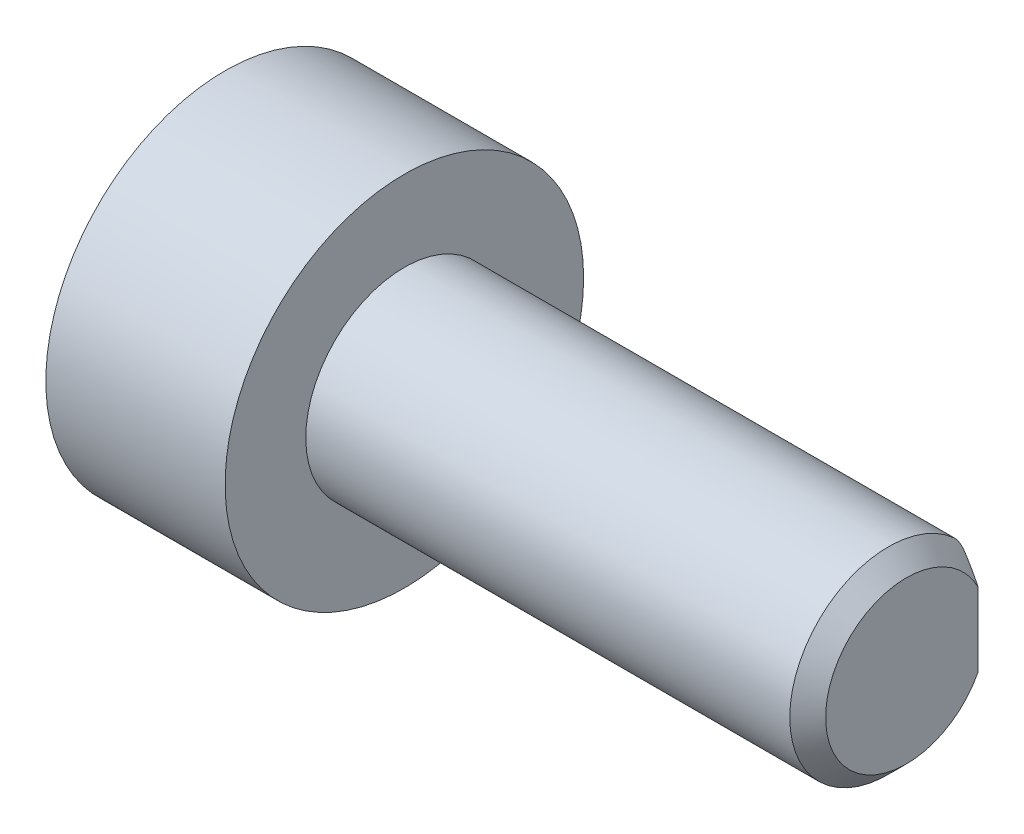
ISO-10303-21;
HEADER;
FILE_DESCRIPTION(('STEP AP214'),'2;1');
FILE_NAME('part.step','',(''),(''),'','','');
FILE_SCHEMA(('AUTOMOTIVE_DESIGN { 1 0 10303 214 1 1 1 1 }'));
ENDSEC;
DATA;
#1=APPLICATION_CONTEXT('core data for automotive mechanical design processes');
#2=APPLICATION_PROTOCOL_DEFINITION('international standard','automotive_design',2000,#1);
#3=PRODUCT_CONTEXT('',#1,'mechanical');
#4=PRODUCT('Part','Part','',(#3));
#5=PRODUCT_RELATED_PRODUCT_CATEGORY('part','',(#4));
#6=PRODUCT_DEFINITION_FORMATION('','',#4);
#7=PRODUCT_DEFINITION_CONTEXT('part definition',#1,'design');
#8=PRODUCT_DEFINITION('design','',#6,#7);
#9=PRODUCT_DEFINITION_SHAPE('','',#8);
#10=(LENGTH_UNIT() NAMED_UNIT(*) SI_UNIT(.MILLI.,.METRE.));
#11=(NAMED_UNIT(*) PLANE_ANGLE_UNIT() SI_UNIT($,.RADIAN.));
#12=(NAMED_UNIT(*) SI_UNIT($,.STERADIAN.) SOLID_ANGLE_UNIT());
#13=UNCERTAINTY_MEASURE_WITH_UNIT(LENGTH_MEASURE(1.E-05),#10,'distance_accuracy_value','');
#14=(GEOMETRIC_REPRESENTATION_CONTEXT(3) GLOBAL_UNCERTAINTY_ASSIGNED_CONTEXT((#13)) GLOBAL_UNIT_ASSIGNED_CONTEXT((#10,
#11,#12)) REPRESENTATION_CONTEXT('',''));
#15=CARTESIAN_POINT('',(0.,0.,0.));
#16=DIRECTION('',(0.,0.,1.));
#17=DIRECTION('',(1.,0.,0.));
#18=AXIS2_PLACEMENT_3D('',#15,#16,#17);
#19=CARTESIAN_POINT('',(21.2171867327833,0.,-7.5));
#20=DIRECTION('',(1.,0.,0.));
#21=DIRECTION('',(0.,0.,-1.));
#22=AXIS2_PLACEMENT_3D('',#19,#20,#21);
#23=PLANE('',#22);
#24=DIRECTION('',(0.,-1.,0.));
#25=VECTOR('',#24,1.);
#26=CARTESIAN_POINT('',(21.2171867327833,0.,-9.5));
#27=LINE('',#26,#25);
#28=CARTESIAN_POINT('',(21.2171867327833,1.03077640640442,-9.5));
#29=VERTEX_POINT('',#28);
#30=CARTESIAN_POINT('',(21.2171867327833,-1.03077640640442,-9.5));
#31=VERTEX_POINT('',#30);
#32=EDGE_CURVE('E123',#29,#31,#27,.T.);
#33=ORIENTED_EDGE('',*,*,#32,.F.);
#34=CARTESIAN_POINT('',(21.2171867327833,0.,-7.5));
#35=DIRECTION('',(1.,0.,0.));
#36=DIRECTION('',(0.,0.,-1.));
#37=AXIS2_PLACEMENT_3D('',#34,#35,#36);
#38=CIRCLE('',#37,2.25);
#39=EDGE_CURVE('E136',#29,#31,#38,.T.);
#40=ORIENTED_EDGE('',*,*,#39,.T.);
#41=EDGE_LOOP('',(#33,#40));
#42=FACE_BOUND('',#41,.T.);
#43=ADVANCED_FACE('F73',(#42),#23,.T.);
#44=CARTESIAN_POINT('',(8.21718673278332,0.,-9.5));
#45=DIRECTION('',(0.,0.,1.));
#46=DIRECTION('',(1.,0.,0.));
#47=AXIS2_PLACEMENT_3D('',#44,#45,#46);
#48=PLANE('',#47);
#49=DIRECTION('',(0.,-1.,0.));
#50=VECTOR('',#49,1.);
#51=CARTESIAN_POINT('',(8.21718673278332,0.,-9.5));
#52=LINE('',#51,#50);
#53=CARTESIAN_POINT('',(8.21718673278332,1.67705098312484,-9.5));
#54=VERTEX_POINT('',#53);
#55=CARTESIAN_POINT('',(8.21718673278332,-1.67705098312484,-9.5));
#56=VERTEX_POINT('',#55);
#57=EDGE_CURVE('E138',#54,#56,#52,.T.);
#58=ORIENTED_EDGE('',*,*,#57,.F.);
#59=DIRECTION('',(-1.,0.,0.));
#60=VECTOR('',#59,1.);
#61=CARTESIAN_POINT('',(8.21718673278332,1.67705098312484,-9.5));
#62=LINE('',#61,#60);
#63=CARTESIAN_POINT('',(20.8571101055613,1.67705098311606,-9.5));
#64=VERTEX_POINT('',#63);
#65=EDGE_CURVE('E126',#54,#64,#62,.F.);
#66=ORIENTED_EDGE('',*,*,#65,.T.);
#67=CARTESIAN_POINT('',(18.1411430279599,4.93626797749979,-9.5));
#68=CARTESIAN_POINT('',(18.2788130430156,4.78768381124845,-9.5));
#69=CARTESIAN_POINT('',(18.4160555329536,4.63869756596273,-9.5));
#70=CARTESIAN_POINT('',(18.6893271391354,4.33955728207182,-9.5));
#71=CARTESIAN_POINT('',(18.8253559820497,4.18940299398388,-9.5));
#72=CARTESIAN_POINT('',(19.0965910697694,3.88672415849227,-9.5));
#73=CARTESIAN_POINT('',(19.2317875058129,3.7341908006299,-9.5));
#74=CARTESIAN_POINT('',(19.4998706434131,3.42713160304089,-9.5));
#75=CARTESIAN_POINT('',(19.6327576154559,3.27260600039063,-9.5));
#76=CARTESIAN_POINT('',(19.8688283379667,2.99210640438999,-9.5));
#77=CARTESIAN_POINT('',(19.9726119138857,2.86663901089742,-9.5));
#78=CARTESIAN_POINT('',(20.1772539947885,2.61328277643716,-9.5));
#79=CARTESIAN_POINT('',(20.2781117860458,2.48539335700056,-9.5));
#80=CARTESIAN_POINT('',(20.475485774688,2.22650548443355,-9.5));
#81=CARTESIAN_POINT('',(20.5720069701796,2.09551089088957,-9.5));
#82=CARTESIAN_POINT('',(20.7119538518751,1.89566419584529,-9.5));
#83=CARTESIAN_POINT('',(20.7577892341795,1.82850179908419,-9.5));
#84=CARTESIAN_POINT('',(20.8474326024016,1.69284128038714,-9.5));
#85=CARTESIAN_POINT('',(20.8912408129102,1.6243433076209,-9.5));
#86=CARTESIAN_POINT('',(20.9749435615259,1.48797798387185,-9.5));
#87=CARTESIAN_POINT('',(21.0149183529494,1.42016017631465,-9.5));
#88=CARTESIAN_POINT('',(21.0918133765513,1.28282423563599,-9.5));
#89=CARTESIAN_POINT('',(21.128734302444,1.21330649334524,-9.5));
#90=CARTESIAN_POINT('',(21.1986682538951,1.07234023444371,-9.5));
#91=CARTESIAN_POINT('',(21.2316829079463,1.00089253778241,-9.5));
#92=CARTESIAN_POINT('',(21.2927268461574,0.855927305144281,-9.5));
#93=CARTESIAN_POINT('',(21.3207575240726,0.782410354510833,-9.5));
#94=CARTESIAN_POINT('',(21.3845148498145,0.591196656014617,-9.5));
#95=CARTESIAN_POINT('',(21.4157234133134,0.471874440503055,-9.5));
#96=CARTESIAN_POINT('',(21.4470852865637,0.290464949037778,-9.5));
#97=CARTESIAN_POINT('',(21.4549638228976,0.229673626127389,-9.5));
#98=CARTESIAN_POINT('',(21.4652144208217,0.107614500574365,-9.5));
#99=CARTESIAN_POINT('',(21.4675868079584,0.0463467263164306,-9.5));
#100=CARTESIAN_POINT('',(21.466674366834,-0.0763197942470239,-9.5));
#101=CARTESIAN_POINT('',(21.4633732659135,-0.13771841112712,-9.5));
#102=CARTESIAN_POINT('',(21.4512794655696,-0.259968375583727,-9.5));
#103=CARTESIAN_POINT('',(21.4424863337877,-0.32081967969058,-9.5));
#104=CARTESIAN_POINT('',(21.41984523005,-0.441758386957264,-9.5));
#105=CARTESIAN_POINT('',(21.4059815262378,-0.501842803788235,-9.5));
#106=CARTESIAN_POINT('',(21.3738365275551,-0.620801694696711,-9.5));
#107=CARTESIAN_POINT('',(21.3555550213248,-0.679676110738195,-9.5));
#108=CARTESIAN_POINT('',(21.2907204712733,-0.867010178133702,-9.5));
#109=CARTESIAN_POINT('',(21.2368423419104,-0.992934833748139,-9.5));
#110=CARTESIAN_POINT('',(21.1170061911796,-1.23892735531401,-9.5));
#111=CARTESIAN_POINT('',(21.0510237798956,-1.35898276485903,-9.5));
#112=CARTESIAN_POINT('',(20.9103161028592,-1.59585458502191,-9.5));
#113=CARTESIAN_POINT('',(20.8354907158075,-1.71261073718882,-9.5));
#114=CARTESIAN_POINT('',(20.6805236919714,-1.94233316376554,-9.5));
#115=CARTESIAN_POINT('',(20.6003869585216,-2.0553027926301,-9.5));
#116=CARTESIAN_POINT('',(20.4256403467432,-2.29310526083194,-9.5));
#117=CARTESIAN_POINT('',(20.3305098463042,-2.41755314631458,-9.5));
#118=CARTESIAN_POINT('',(20.1369570918174,-2.6638718544649,-9.5));
#119=CARTESIAN_POINT('',(20.0385343725834,-2.78574230894001,-9.5));
#120=CARTESIAN_POINT('',(19.8392448282164,-3.02764935246807,-9.5));
#121=CARTESIAN_POINT('',(19.7383758414546,-3.14768415452677,-9.5));
#122=CARTESIAN_POINT('',(19.5348934572522,-3.38626695152412,-9.5));
#123=CARTESIAN_POINT('',(19.4322800159241,-3.50481490892543,-9.5));
#124=CARTESIAN_POINT('',(19.231695068775,-3.73393503767577,-9.5));
#125=CARTESIAN_POINT('',(19.1337978298912,-3.84457235346526,-9.5));
#126=CARTESIAN_POINT('',(18.9370739733265,-4.06502066506249,-9.5));
#127=CARTESIAN_POINT('',(18.8382473370923,-4.17483164429524,-9.5));
#128=CARTESIAN_POINT('',(18.6400483457893,-4.39356418106756,-9.5));
#129=CARTESIAN_POINT('',(18.5406774558616,-4.50248706778862,-9.5));
#130=CARTESIAN_POINT('',(18.3413316646478,-4.71977019005837,-9.5));
#131=CARTESIAN_POINT('',(18.2413567898755,-4.82813044992246,-9.5));
#132=CARTESIAN_POINT('',(18.1411430279599,-4.93626797749979,-9.5));
#133=B_SPLINE_CURVE_WITH_KNOTS('',3,(#67,#68,#69,#70,#71,#72,#73,#74,#75,#76,#77,#78,#79,#80,
#81,#82,#83,#84,#85,#86,#87,#88,#89,#90,#91,#92,#93,#94,#95,#96,#97,#98,#99,#100,#101,#102,#103,
#104,#105,#106,#107,#108,#109,#110,#111,#112,#113,#114,#115,#116,#117,#118,#119,#120,#121,#122,
#123,#124,#125,#126,#127,#128,#129,#130,#131,#132),.UNSPECIFIED.,.F.,.F.,(4,2,2,2,2,2,2,2,2,2,2,
2,2,2,2,2,2,2,2,2,2,2,2,2,2,2,2,2,2,2,2,2,4),(0.,0.607683822515698,1.21550121371795,
1.82695959733874,2.43834587720767,2.92679827952436,3.41536885142092,3.90336106917609,
4.14727001406462,4.39115187121072,4.62725676477005,4.86330787673308,5.09926023157596,
5.33514649886008,5.70350071953634,5.88718743593393,6.07086329173091,6.25506684494243,
6.4392849013503,6.62407942586769,6.80888279321206,7.21864694206685,7.62924601323271,
8.04504397302747,8.46046328332824,8.93031101628626,9.40022542091194,9.87057139026385,
10.3409292103109,10.7841162696073,11.2273121949651,11.6696319276303,12.1119323824531),.UNSPECIFIED.);
#134=EDGE_CURVE('E120',#64,#29,#133,.T.);
#135=ORIENTED_EDGE('',*,*,#134,.T.);
#136=ORIENTED_EDGE('',*,*,#32,.T.);
#137=CARTESIAN_POINT('',(20.8571101055557,-1.67705098312487,-9.5));
#138=VERTEX_POINT('',#137);
#139=EDGE_CURVE('E132',#31,#138,#133,.T.);
#140=ORIENTED_EDGE('',*,*,#139,.T.);
#141=DIRECTION('',(-1.,0.,0.));
#142=VECTOR('',#141,1.);
#143=CARTESIAN_POINT('',(8.21718673278332,-1.67705098312484,-9.5));
#144=LINE('',#143,#142);
#145=EDGE_CURVE('E90',#138,#56,#144,.T.);
#146=ORIENTED_EDGE('',*,*,#145,.T.);
#147=EDGE_LOOP('',(#58,#66,#135,#136,#140,#146));
#148=FACE_BOUND('',#147,.T.);
#149=ADVANCED_FACE('F122',(#148),#48,.F.);
#150=CARTESIAN_POINT('',(21.2171867327833,-1.67705098312484,-9.));
#151=DIRECTION('',(-1.,0.,0.));
#152=DIRECTION('',(0.,0.,1.));
#153=AXIS2_PLACEMENT_3D('',#150,#151,#152);
#154=CYLINDRICAL_SURFACE('',#153,0.5);
#155=CARTESIAN_POINT('',(8.21718673278332,-1.67705098312484,-9.));
#156=DIRECTION('',(1.,0.,0.));
#157=DIRECTION('',(0.,0.,-1.));
#158=AXIS2_PLACEMENT_3D('',#155,#156,#157);
#159=CIRCLE('',#158,0.5);
#160=CARTESIAN_POINT('',(8.21718673278332,-2.0497289793748,-9.33333333333333));
#161=VERTEX_POINT('',#160);
#162=EDGE_CURVE('E12',#56,#161,#159,.F.);
#163=ORIENTED_EDGE('',*,*,#162,.F.);
#164=ORIENTED_EDGE('',*,*,#145,.F.);
#165=CARTESIAN_POINT('',(20.7171867327833,-2.0497289793748,-9.33333333333333));
#166=CARTESIAN_POINT('',(20.7171604513596,-2.03406008435981,-9.35090657468825));
#167=CARTESIAN_POINT('',(20.718545206187,-2.01712587378831,-9.36729410292724));
#168=CARTESIAN_POINT('',(20.7239153109135,-1.98150274794836,-9.39728784026081));
#169=CARTESIAN_POINT('',(20.72788352115,-1.96282608750837,-9.41091160935768));
#170=CARTESIAN_POINT('',(20.7381954360339,-1.92430344352461,-9.43518626032212));
#171=CARTESIAN_POINT('',(20.7445351160157,-1.90445948883267,-9.44584212592262));
#172=CARTESIAN_POINT('',(20.7592855750011,-1.86415682498977,-9.46420065151583));
#173=CARTESIAN_POINT('',(20.7676999401024,-1.84369710582503,-9.47189813836426));
#174=CARTESIAN_POINT('',(20.7869249029712,-1.80125368819481,-9.48487212739723));
#175=CARTESIAN_POINT('',(20.7978629879389,-1.77926466300742,-9.48993860384102));
#176=CARTESIAN_POINT('',(20.8213465509876,-1.73570122571514,-9.49703799103409));
#177=CARTESIAN_POINT('',(20.8338903416531,-1.7141264053145,-9.4990740584367));
#178=CARTESIAN_POINT('',(20.8503785908946,-1.68761215599062,-9.49991682265028));
#179=CARTESIAN_POINT('',(20.8537256314886,-1.68231822084312,-9.50000010394867));
#180=CARTESIAN_POINT('',(20.8571101055586,-1.6770509831203,-9.5));
#181=B_SPLINE_CURVE_WITH_KNOTS('',3,(#165,#166,#167,#168,#169,#170,#171,#172,#173,#174,#175,
#176,#177,#178,#179,#180),.UNSPECIFIED.,.F.,.F.,(4,2,2,2,2,2,2,4),(0.,0.0704675223576055,
0.140472235075229,0.210358676557888,0.280366774315093,0.355332149179519,0.430219380889106,
0.449006975884522),.UNSPECIFIED.);
#182=CARTESIAN_POINT('',(20.7171867327833,-2.0497289793748,-9.33333333333333));
#183=VERTEX_POINT('',#182);
#184=EDGE_CURVE('E169',#183,#138,#181,.T.);
#185=ORIENTED_EDGE('',*,*,#184,.F.);
#186=DIRECTION('',(-1.,0.,0.));
#187=VECTOR('',#186,1.);
#188=CARTESIAN_POINT('',(21.2171867327833,-2.0497289793748,-9.33333333333333));
#189=LINE('',#188,#187);
#190=EDGE_CURVE('E157',#161,#183,#189,.F.);
#191=ORIENTED_EDGE('',*,*,#190,.F.);
#192=EDGE_LOOP('',(#163,#164,#185,#191));
#193=FACE_BOUND('',#192,.T.);
#194=ADVANCED_FACE('F75',(#193),#154,.T.);
#195=CARTESIAN_POINT('',(8.21718673278332,0.,0.));
#196=DIRECTION('',(1.,0.,0.));
#197=DIRECTION('',(0.,0.,-1.));
#198=AXIS2_PLACEMENT_3D('',#195,#196,#197);
#199=PLANE('',#198);
#200=CARTESIAN_POINT('',(8.21718673278332,0.,-7.5));
#201=DIRECTION('',(1.,0.,0.));
#202=DIRECTION('',(0.,0.,-1.));
#203=AXIS2_PLACEMENT_3D('',#200,#201,#202);
#204=CIRCLE('',#203,2.75);
#205=CARTESIAN_POINT('',(8.21718673278332,2.04972897937481,-9.33333333333333));
#206=VERTEX_POINT('',#205);
#207=EDGE_CURVE('E149',#161,#206,#204,.T.);
#208=ORIENTED_EDGE('',*,*,#207,.T.);
#209=CARTESIAN_POINT('',(8.21718673278332,1.67705098312484,-9.));
#210=DIRECTION('',(1.,0.,0.));
#211=DIRECTION('',(0.,0.,-1.));
#212=AXIS2_PLACEMENT_3D('',#209,#210,#211);
#213=CIRCLE('',#212,0.5);
#214=EDGE_CURVE('E83',#206,#54,#213,.F.);
#215=ORIENTED_EDGE('',*,*,#214,.T.);
#216=ORIENTED_EDGE('',*,*,#57,.T.);
#217=ORIENTED_EDGE('',*,*,#162,.T.);
#218=EDGE_LOOP('',(#208,#215,#216,#217));
#219=FACE_BOUND('',#218,.T.);
#220=ADVANCED_FACE('F203',(#219),#199,.T.);
#221=CARTESIAN_POINT('',(21.2171867327833,1.67705098312484,-9.));
#222=DIRECTION('',(-1.,0.,0.));
#223=DIRECTION('',(0.,0.,1.));
#224=AXIS2_PLACEMENT_3D('',#221,#222,#223);
#225=CYLINDRICAL_SURFACE('',#224,0.5);
#226=CARTESIAN_POINT('',(20.8571101055613,1.67705098312484,-9.5));
#227=CARTESIAN_POINT('',(20.8415496974984,1.70124944097462,-9.5000148527075));
#228=CARTESIAN_POINT('',(20.8267655707064,1.72606787067869,-9.49824108320522));
#229=CARTESIAN_POINT('',(20.799206935048,1.77644423051924,-9.49068481003503));
#230=CARTESIAN_POINT('',(20.7864488708806,1.80200639830253,-9.48487137689067));
#231=CARTESIAN_POINT('',(20.7654036136021,1.84906984601313,-9.47002288433717));
#232=CARTESIAN_POINT('',(20.7567309273932,1.87059336762355,-9.46161773600028));
#233=CARTESIAN_POINT('',(20.741760286762,1.91281174579968,-9.44154273159468));
#234=CARTESIAN_POINT('',(20.7354504423934,1.93351026990007,-9.42988975058789));
#235=CARTESIAN_POINT('',(20.7261397670755,1.97088949039679,-9.40508469993059));
#236=CARTESIAN_POINT('',(20.7228181713674,1.98774489361128,-9.3923170049847));
#237=CARTESIAN_POINT('',(20.7183236569058,2.02000307567556,-9.36448352788813));
#238=CARTESIAN_POINT('',(20.7171688583107,2.03539259150949,-9.34939949693643));
#239=CARTESIAN_POINT('',(20.7171867327833,2.0497289793748,-9.33333333333333));
#240=B_SPLINE_CURVE_WITH_KNOTS('',3,(#226,#227,#228,#229,#230,#231,#232,#233,#234,#235,#236,
#237,#238,#239),.UNSPECIFIED.,.F.,.F.,(4,2,2,2,2,2,4),(0.,0.0863985690914003,0.173466039674812,
0.247196248615131,0.320550291890411,0.384489364918406,0.448960795055635),.UNSPECIFIED.);
#241=CARTESIAN_POINT('',(20.7171867327833,2.04972897937481,-9.33333333333333));
#242=VERTEX_POINT('',#241);
#243=EDGE_CURVE('E177',#64,#242,#240,.T.);
#244=ORIENTED_EDGE('',*,*,#243,.F.);
#245=ORIENTED_EDGE('',*,*,#65,.F.);
#246=ORIENTED_EDGE('',*,*,#214,.F.);
#247=DIRECTION('',(-1.,0.,0.));
#248=VECTOR('',#247,1.);
#249=CARTESIAN_POINT('',(21.2171867327833,2.04972897937481,-9.33333333333333));
#250=LINE('',#249,#248);
#251=EDGE_CURVE('E161',#242,#206,#250,.T.);
#252=ORIENTED_EDGE('',*,*,#251,.F.);
#253=EDGE_LOOP('',(#244,#245,#246,#252));
#254=FACE_BOUND('',#253,.T.);
#255=ADVANCED_FACE('F186',(#254),#225,.T.);
#256=CARTESIAN_POINT('',(21.2171867327833,0.,-7.5));
#257=DIRECTION('',(-1.,0.,0.));
#258=DIRECTION('',(0.,0.,1.));
#259=AXIS2_PLACEMENT_3D('',#256,#257,#258);
#260=CONICAL_SURFACE('',#259,2.25,0.785398163397451);
#261=ORIENTED_EDGE('',*,*,#134,.F.);
#262=ORIENTED_EDGE('',*,*,#243,.T.);
#263=CARTESIAN_POINT('',(20.7171867327833,0.,-7.5));
#264=DIRECTION('',(1.,0.,0.));
#265=DIRECTION('',(0.,0.,-1.));
#266=AXIS2_PLACEMENT_3D('',#263,#264,#265);
#267=CIRCLE('',#266,2.75);
#268=EDGE_CURVE('E143',#183,#242,#267,.F.);
#269=ORIENTED_EDGE('',*,*,#268,.F.);
#270=ORIENTED_EDGE('',*,*,#184,.T.);
#271=ORIENTED_EDGE('',*,*,#139,.F.);
#272=ORIENTED_EDGE('',*,*,#39,.F.);
#273=EDGE_LOOP('',(#261,#262,#269,#270,#271,#272));
#274=FACE_BOUND('',#273,.T.);
#275=ADVANCED_FACE('F141',(#274),#260,.T.);
#276=CARTESIAN_POINT('',(21.2171867327833,0.,-7.5));
#277=DIRECTION('',(-1.,0.,0.));
#278=DIRECTION('',(0.,0.,1.));
#279=AXIS2_PLACEMENT_3D('',#276,#277,#278);
#280=CYLINDRICAL_SURFACE('',#279,2.75);
#281=ORIENTED_EDGE('',*,*,#268,.T.);
#282=ORIENTED_EDGE('',*,*,#251,.T.);
#283=ORIENTED_EDGE('',*,*,#207,.F.);
#284=ORIENTED_EDGE('',*,*,#190,.T.);
#285=EDGE_LOOP('',(#281,#282,#283,#284));
#286=FACE_BOUND('',#285,.T.);
#287=CARTESIAN_POINT('',(7.21718673278332,0.,-7.5));
#288=DIRECTION('',(1.,0.,0.));
#289=DIRECTION('',(0.,0.,-1.));
#290=AXIS2_PLACEMENT_3D('',#287,#288,#289);
#291=CIRCLE('',#290,2.75);
#292=CARTESIAN_POINT('',(7.21718673278332,0.,-10.25));
#293=VERTEX_POINT('',#292);
#294=EDGE_CURVE('E144',#293,#293,#291,.T.);
#295=ORIENTED_EDGE('',*,*,#294,.T.);
#296=EDGE_LOOP('',(#295));
#297=FACE_BOUND('',#296,.T.);
#298=ADVANCED_FACE('F185',(#286,#297),#280,.T.);
#299=CARTESIAN_POINT('',(7.21718673278332,0.,-7.5));
#300=DIRECTION('',(1.,0.,0.));
#301=DIRECTION('',(0.,0.,-1.));
#302=AXIS2_PLACEMENT_3D('',#299,#300,#301);
#303=PLANE('',#302);
#304=ORIENTED_EDGE('',*,*,#294,.F.);
#305=EDGE_LOOP('',(#304));
#306=FACE_BOUND('',#305,.T.);
#307=CARTESIAN_POINT('',(7.21718673278332,0.,-7.5));
#308=DIRECTION('',(1.,0.,0.));
#309=DIRECTION('',(0.,0.,-1.));
#310=AXIS2_PLACEMENT_3D('',#307,#308,#309);
#311=CIRCLE('',#310,5.);
#312=CARTESIAN_POINT('',(7.21718673278332,0.,-12.5));
#313=VERTEX_POINT('',#312);
#314=EDGE_CURVE('E131',#313,#313,#311,.T.);
#315=ORIENTED_EDGE('',*,*,#314,.T.);
#316=EDGE_LOOP('',(#315));
#317=FACE_BOUND('',#316,.T.);
#318=ADVANCED_FACE('F187',(#306,#317),#303,.T.);
#319=CARTESIAN_POINT('',(6.71718673278332,0.,-7.5));
#320=DIRECTION('',(1.,0.,0.));
#321=DIRECTION('',(0.,0.,-1.));
#322=AXIS2_PLACEMENT_3D('',#319,#320,#321);
#323=CYLINDRICAL_SURFACE('',#322,5.);
#324=ORIENTED_EDGE('',*,*,#314,.F.);
#325=EDGE_LOOP('',(#324));
#326=FACE_BOUND('',#325,.T.);
#327=CARTESIAN_POINT('',(2.21718673278332,0.,-7.5));
#328=DIRECTION('',(1.,0.,0.));
#329=DIRECTION('',(0.,0.,-1.));
#330=AXIS2_PLACEMENT_3D('',#327,#328,#329);
#331=CIRCLE('',#330,5.);
#332=CARTESIAN_POINT('',(2.21718673278332,0.,-12.5));
#333=VERTEX_POINT('',#332);
#334=EDGE_CURVE('E139',#333,#333,#331,.F.);
#335=ORIENTED_EDGE('',*,*,#334,.F.);
#336=EDGE_LOOP('',(#335));
#337=FACE_BOUND('',#336,.T.);
#338=ADVANCED_FACE('F205',(#326,#337),#323,.T.);
#339=CARTESIAN_POINT('',(2.21718673278332,0.,0.));
#340=DIRECTION('',(1.,0.,0.));
#341=DIRECTION('',(0.,0.,-1.));
#342=AXIS2_PLACEMENT_3D('',#339,#340,#341);
#343=PLANE('',#342);
#344=ORIENTED_EDGE('',*,*,#334,.T.);
#345=EDGE_LOOP('',(#344));
#346=FACE_BOUND('',#345,.T.);
#347=ADVANCED_FACE('F208',(#346),#343,.F.);
#348=CLOSED_SHELL('',(#43,#149,#194,#220,#255,#275,#298,#318,#338,#347));
#349=MANIFOLD_SOLID_BREP('B2',#348);
#350=ADVANCED_BREP_SHAPE_REPRESENTATION('',(#18,#349),#14);
#351=SHAPE_DEFINITION_REPRESENTATION(#9,#350);
ENDSEC;
END-ISO-10303-21;
